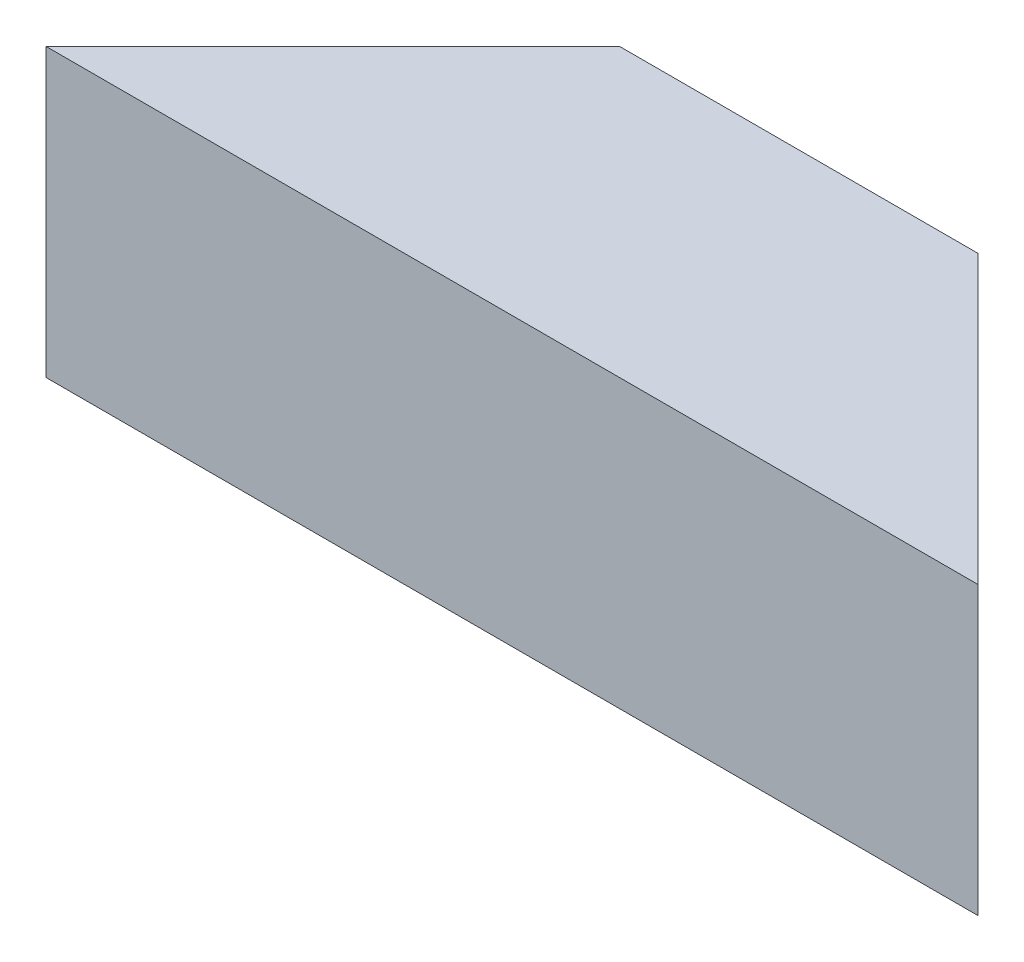
ISO-10303-21;
HEADER;
FILE_DESCRIPTION(('STEP AP214'),'2;1');
FILE_NAME('part.step','',(''),(''),'','','');
FILE_SCHEMA(('AUTOMOTIVE_DESIGN { 1 0 10303 214 1 1 1 1 }'));
ENDSEC;
DATA;
#1=APPLICATION_CONTEXT('core data for automotive mechanical design processes');
#2=APPLICATION_PROTOCOL_DEFINITION('international standard','automotive_design',2000,#1);
#3=PRODUCT_CONTEXT('',#1,'mechanical');
#4=PRODUCT('Part','Part','',(#3));
#5=PRODUCT_RELATED_PRODUCT_CATEGORY('part','',(#4));
#6=PRODUCT_DEFINITION_FORMATION('','',#4);
#7=PRODUCT_DEFINITION_CONTEXT('part definition',#1,'design');
#8=PRODUCT_DEFINITION('design','',#6,#7);
#9=PRODUCT_DEFINITION_SHAPE('','',#8);
#10=(LENGTH_UNIT() NAMED_UNIT(*) SI_UNIT(.MILLI.,.METRE.));
#11=(NAMED_UNIT(*) PLANE_ANGLE_UNIT() SI_UNIT($,.RADIAN.));
#12=(NAMED_UNIT(*) SI_UNIT($,.STERADIAN.) SOLID_ANGLE_UNIT());
#13=UNCERTAINTY_MEASURE_WITH_UNIT(LENGTH_MEASURE(1.E-05),#10,'distance_accuracy_value','');
#14=(GEOMETRIC_REPRESENTATION_CONTEXT(3) GLOBAL_UNCERTAINTY_ASSIGNED_CONTEXT((#13)) GLOBAL_UNIT_ASSIGNED_CONTEXT((#10,
#11,#12)) REPRESENTATION_CONTEXT('',''));
#15=CARTESIAN_POINT('',(0.,0.,0.));
#16=DIRECTION('',(0.,0.,1.));
#17=DIRECTION('',(1.,0.,0.));
#18=AXIS2_PLACEMENT_3D('',#15,#16,#17);
#19=CARTESIAN_POINT('',(-41.275,-3.175,-3.175));
#20=DIRECTION('',(0.,-1.,0.));
#21=DIRECTION('',(0.,0.,-1.));
#22=AXIS2_PLACEMENT_3D('',#19,#20,#21);
#23=PLANE('',#22);
#24=DIRECTION('',(-1.,0.,0.));
#25=VECTOR('',#24,1.);
#26=CARTESIAN_POINT('',(-41.275,-3.175,-25.4));
#27=LINE('',#26,#25);
#28=CARTESIAN_POINT('',(15.875,-3.175,-25.4));
#29=VERTEX_POINT('',#28);
#30=CARTESIAN_POINT('',(-15.875,-3.175,-25.4));
#31=VERTEX_POINT('',#30);
#32=EDGE_CURVE('E76',#29,#31,#27,.T.);
#33=ORIENTED_EDGE('',*,*,#32,.F.);
#34=DIRECTION('',(0.707106781186548,0.,0.707106781186548));
#35=VECTOR('',#34,1.);
#36=CARTESIAN_POINT('',(15.875,-3.175,-25.4));
#37=LINE('',#36,#35);
#38=CARTESIAN_POINT('',(38.1,-3.175,-3.175));
#39=VERTEX_POINT('',#38);
#40=EDGE_CURVE('E73',#29,#39,#37,.T.);
#41=ORIENTED_EDGE('',*,*,#40,.T.);
#42=DIRECTION('',(-1.,0.,0.));
#43=VECTOR('',#42,1.);
#44=CARTESIAN_POINT('',(-41.275,-3.175,-3.175));
#45=LINE('',#44,#43);
#46=CARTESIAN_POINT('',(-38.1,-3.175,-3.175));
#47=VERTEX_POINT('',#46);
#48=EDGE_CURVE('E20',#47,#39,#45,.F.);
#49=ORIENTED_EDGE('',*,*,#48,.F.);
#50=DIRECTION('',(0.707106781186548,0.,-0.707106781186548));
#51=VECTOR('',#50,1.);
#52=CARTESIAN_POINT('',(-41.275,-3.175,0.));
#53=LINE('',#52,#51);
#54=EDGE_CURVE('E68',#47,#31,#53,.T.);
#55=ORIENTED_EDGE('',*,*,#54,.T.);
#56=EDGE_LOOP('',(#33,#41,#49,#55));
#57=FACE_BOUND('',#56,.T.);
#58=ADVANCED_FACE('F17',(#57),#23,.T.);
#59=CARTESIAN_POINT('',(-41.275,-25.4,-3.175));
#60=DIRECTION('',(0.,0.,-1.));
#61=DIRECTION('',(-1.,0.,0.));
#62=AXIS2_PLACEMENT_3D('',#59,#60,#61);
#63=PLANE('',#62);
#64=ORIENTED_EDGE('',*,*,#48,.T.);
#65=DIRECTION('',(0.,1.,0.));
#66=VECTOR('',#65,1.);
#67=CARTESIAN_POINT('',(38.1,0.,-3.175));
#68=LINE('',#67,#66);
#69=CARTESIAN_POINT('',(38.1,-25.4,-3.175));
#70=VERTEX_POINT('',#69);
#71=EDGE_CURVE('E107',#39,#70,#68,.F.);
#72=ORIENTED_EDGE('',*,*,#71,.T.);
#73=DIRECTION('',(1.,0.,0.));
#74=VECTOR('',#73,1.);
#75=CARTESIAN_POINT('',(-41.275,-25.4,-3.175));
#76=LINE('',#75,#74);
#77=CARTESIAN_POINT('',(-38.1,-25.4,-3.175));
#78=VERTEX_POINT('',#77);
#79=EDGE_CURVE('E80',#78,#70,#76,.T.);
#80=ORIENTED_EDGE('',*,*,#79,.F.);
#81=DIRECTION('',(0.,1.,0.));
#82=VECTOR('',#81,1.);
#83=CARTESIAN_POINT('',(-38.1,0.,-3.175));
#84=LINE('',#83,#82);
#85=EDGE_CURVE('E78',#78,#47,#84,.T.);
#86=ORIENTED_EDGE('',*,*,#85,.T.);
#87=EDGE_LOOP('',(#64,#72,#80,#86));
#88=FACE_BOUND('',#87,.T.);
#89=ADVANCED_FACE('F79',(#88),#63,.T.);
#90=CARTESIAN_POINT('',(-41.275,-3.175,-25.4));
#91=DIRECTION('',(0.,0.,-1.));
#92=DIRECTION('',(-1.,0.,0.));
#93=AXIS2_PLACEMENT_3D('',#90,#91,#92);
#94=PLANE('',#93);
#95=DIRECTION('',(1.,0.,0.));
#96=VECTOR('',#95,1.);
#97=CARTESIAN_POINT('',(-41.275,0.,-25.4));
#98=LINE('',#97,#96);
#99=CARTESIAN_POINT('',(15.875,0.,-25.4));
#100=VERTEX_POINT('',#99);
#101=CARTESIAN_POINT('',(-15.875,0.,-25.4));
#102=VERTEX_POINT('',#101);
#103=EDGE_CURVE('E83',#100,#102,#98,.F.);
#104=ORIENTED_EDGE('',*,*,#103,.F.);
#105=DIRECTION('',(0.,1.,0.));
#106=VECTOR('',#105,1.);
#107=CARTESIAN_POINT('',(15.875,0.,-25.4));
#108=LINE('',#107,#106);
#109=EDGE_CURVE('E99',#100,#29,#108,.F.);
#110=ORIENTED_EDGE('',*,*,#109,.T.);
#111=ORIENTED_EDGE('',*,*,#32,.T.);
#112=DIRECTION('',(0.,1.,0.));
#113=VECTOR('',#112,1.);
#114=CARTESIAN_POINT('',(-15.875,0.,-25.4));
#115=LINE('',#114,#113);
#116=EDGE_CURVE('E88',#31,#102,#115,.T.);
#117=ORIENTED_EDGE('',*,*,#116,.T.);
#118=EDGE_LOOP('',(#104,#110,#111,#117));
#119=FACE_BOUND('',#118,.T.);
#120=ADVANCED_FACE('F97',(#119),#94,.T.);
#121=CARTESIAN_POINT('',(-41.275,0.,-25.4));
#122=DIRECTION('',(0.,1.,0.));
#123=DIRECTION('',(0.,0.,1.));
#124=AXIS2_PLACEMENT_3D('',#121,#122,#123);
#125=PLANE('',#124);
#126=DIRECTION('',(1.,0.,0.));
#127=VECTOR('',#126,1.);
#128=CARTESIAN_POINT('',(-41.275,0.,0.));
#129=LINE('',#128,#127);
#130=CARTESIAN_POINT('',(41.275,0.,0.));
#131=VERTEX_POINT('',#130);
#132=CARTESIAN_POINT('',(-41.275,0.,0.));
#133=VERTEX_POINT('',#132);
#134=EDGE_CURVE('E103',#131,#133,#129,.F.);
#135=ORIENTED_EDGE('',*,*,#134,.F.);
#136=DIRECTION('',(0.707106781186548,0.,0.707106781186548));
#137=VECTOR('',#136,1.);
#138=CARTESIAN_POINT('',(15.875,0.,-25.4));
#139=LINE('',#138,#137);
#140=EDGE_CURVE('E104',#131,#100,#139,.F.);
#141=ORIENTED_EDGE('',*,*,#140,.T.);
#142=ORIENTED_EDGE('',*,*,#103,.T.);
#143=DIRECTION('',(0.707106781186548,0.,-0.707106781186548));
#144=VECTOR('',#143,1.);
#145=CARTESIAN_POINT('',(-41.275,0.,0.));
#146=LINE('',#145,#144);
#147=EDGE_CURVE('E90',#102,#133,#146,.F.);
#148=ORIENTED_EDGE('',*,*,#147,.T.);
#149=EDGE_LOOP('',(#135,#141,#142,#148));
#150=FACE_BOUND('',#149,.T.);
#151=ADVANCED_FACE('F116',(#150),#125,.T.);
#152=CARTESIAN_POINT('',(-41.275,0.,0.));
#153=DIRECTION('',(0.707106781186548,0.,0.707106781186548));
#154=DIRECTION('',(0.707106781186548,0.,-0.707106781186548));
#155=AXIS2_PLACEMENT_3D('',#152,#153,#154);
#156=PLANE('',#155);
#157=ORIENTED_EDGE('',*,*,#147,.F.);
#158=ORIENTED_EDGE('',*,*,#116,.F.);
#159=ORIENTED_EDGE('',*,*,#54,.F.);
#160=ORIENTED_EDGE('',*,*,#85,.F.);
#161=DIRECTION('',(0.707106781186548,0.,-0.707106781186547));
#162=VECTOR('',#161,1.);
#163=CARTESIAN_POINT('',(-41.275,-25.4,0.));
#164=LINE('',#163,#162);
#165=CARTESIAN_POINT('',(-41.275,-25.4,0.));
#166=VERTEX_POINT('',#165);
#167=EDGE_CURVE('E110',#166,#78,#164,.T.);
#168=ORIENTED_EDGE('',*,*,#167,.F.);
#169=DIRECTION('',(0.,1.,0.));
#170=VECTOR('',#169,1.);
#171=CARTESIAN_POINT('',(-41.275,0.,0.));
#172=LINE('',#171,#170);
#173=EDGE_CURVE('E119',#133,#166,#172,.F.);
#174=ORIENTED_EDGE('',*,*,#173,.F.);
#175=EDGE_LOOP('',(#157,#158,#159,#160,#168,#174));
#176=FACE_BOUND('',#175,.T.);
#177=ADVANCED_FACE('F87',(#176),#156,.F.);
#178=CARTESIAN_POINT('',(-41.275,-25.4,0.));
#179=DIRECTION('',(0.,-1.,0.));
#180=DIRECTION('',(0.,0.,-1.));
#181=AXIS2_PLACEMENT_3D('',#178,#179,#180);
#182=PLANE('',#181);
#183=ORIENTED_EDGE('',*,*,#79,.T.);
#184=DIRECTION('',(0.707106781186548,0.,0.707106781186548));
#185=VECTOR('',#184,1.);
#186=CARTESIAN_POINT('',(15.875,-25.4,-25.4));
#187=LINE('',#186,#185);
#188=CARTESIAN_POINT('',(41.275,-25.4,0.));
#189=VERTEX_POINT('',#188);
#190=EDGE_CURVE('E35',#70,#189,#187,.T.);
#191=ORIENTED_EDGE('',*,*,#190,.T.);
#192=DIRECTION('',(1.,0.,0.));
#193=VECTOR('',#192,1.);
#194=CARTESIAN_POINT('',(-41.275,-25.4,0.));
#195=LINE('',#194,#193);
#196=EDGE_CURVE('E26',#166,#189,#195,.T.);
#197=ORIENTED_EDGE('',*,*,#196,.F.);
#198=ORIENTED_EDGE('',*,*,#167,.T.);
#199=EDGE_LOOP('',(#183,#191,#197,#198));
#200=FACE_BOUND('',#199,.T.);
#201=ADVANCED_FACE('F127',(#200),#182,.T.);
#202=CARTESIAN_POINT('',(15.875,0.,-25.4));
#203=DIRECTION('',(-0.707106781186548,0.,0.707106781186548));
#204=DIRECTION('',(0.707106781186548,0.,0.707106781186548));
#205=AXIS2_PLACEMENT_3D('',#202,#203,#204);
#206=PLANE('',#205);
#207=ORIENTED_EDGE('',*,*,#140,.F.);
#208=DIRECTION('',(0.,1.,0.));
#209=VECTOR('',#208,1.);
#210=CARTESIAN_POINT('',(41.275,0.,0.));
#211=LINE('',#210,#209);
#212=EDGE_CURVE('E11',#189,#131,#211,.T.);
#213=ORIENTED_EDGE('',*,*,#212,.F.);
#214=ORIENTED_EDGE('',*,*,#190,.F.);
#215=ORIENTED_EDGE('',*,*,#71,.F.);
#216=ORIENTED_EDGE('',*,*,#40,.F.);
#217=ORIENTED_EDGE('',*,*,#109,.F.);
#218=EDGE_LOOP('',(#207,#213,#214,#215,#216,#217));
#219=FACE_BOUND('',#218,.T.);
#220=ADVANCED_FACE('F106',(#219),#206,.F.);
#221=CARTESIAN_POINT('',(-41.275,0.,0.));
#222=DIRECTION('',(0.,0.,1.));
#223=DIRECTION('',(1.,0.,0.));
#224=AXIS2_PLACEMENT_3D('',#221,#222,#223);
#225=PLANE('',#224);
#226=ORIENTED_EDGE('',*,*,#196,.T.);
#227=ORIENTED_EDGE('',*,*,#212,.T.);
#228=ORIENTED_EDGE('',*,*,#134,.T.);
#229=ORIENTED_EDGE('',*,*,#173,.T.);
#230=EDGE_LOOP('',(#226,#227,#228,#229));
#231=FACE_BOUND('',#230,.T.);
#232=ADVANCED_FACE('F123',(#231),#225,.T.);
#233=CLOSED_SHELL('',(#58,#89,#120,#151,#177,#201,#220,#232));
#234=MANIFOLD_SOLID_BREP('B1',#233);
#235=ADVANCED_BREP_SHAPE_REPRESENTATION('',(#18,#234),#14);
#236=SHAPE_DEFINITION_REPRESENTATION(#9,#235);
ENDSEC;
END-ISO-10303-21;
